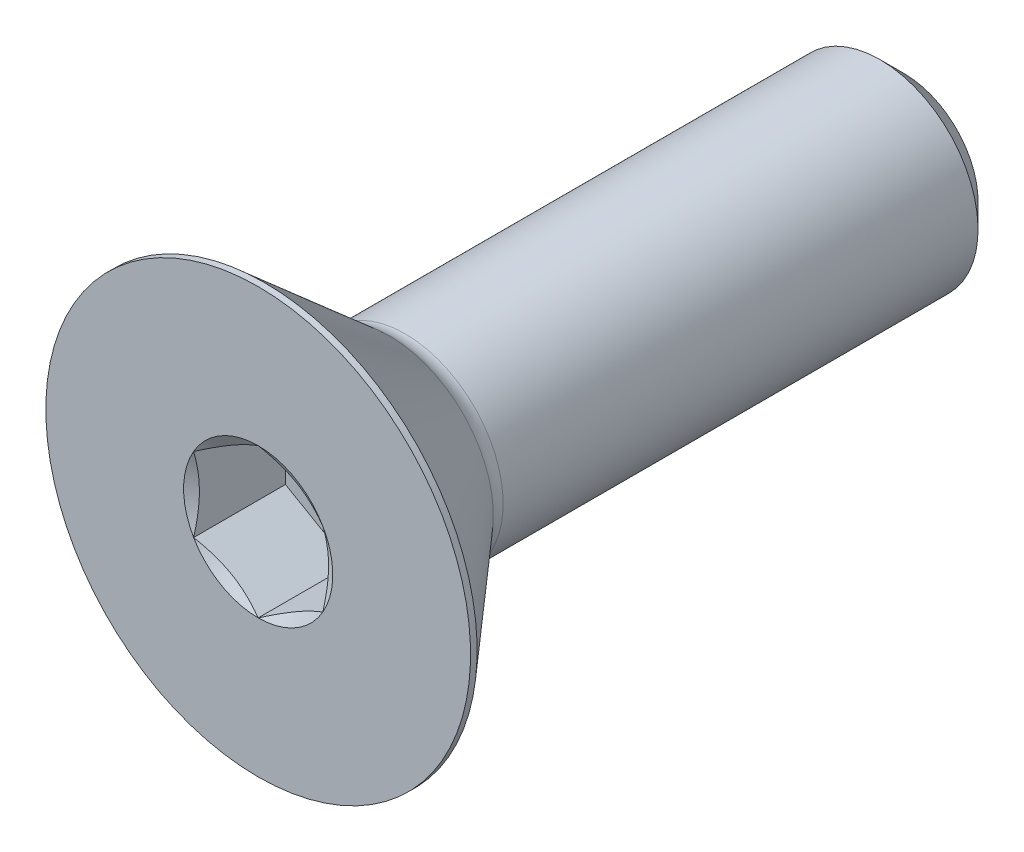
ISO-10303-21;
HEADER;
FILE_DESCRIPTION(('STEP AP214'),'2;1');
FILE_NAME('part.step','',(''),(''),'','','');
FILE_SCHEMA(('AUTOMOTIVE_DESIGN { 1 0 10303 214 1 1 1 1 }'));
ENDSEC;
DATA;
#1=APPLICATION_CONTEXT('core data for automotive mechanical design processes');
#2=APPLICATION_PROTOCOL_DEFINITION('international standard','automotive_design',2000,#1);
#3=PRODUCT_CONTEXT('',#1,'mechanical');
#4=PRODUCT('Part','Part','',(#3));
#5=PRODUCT_RELATED_PRODUCT_CATEGORY('part','',(#4));
#6=PRODUCT_DEFINITION_FORMATION('','',#4);
#7=PRODUCT_DEFINITION_CONTEXT('part definition',#1,'design');
#8=PRODUCT_DEFINITION('design','',#6,#7);
#9=PRODUCT_DEFINITION_SHAPE('','',#8);
#10=(LENGTH_UNIT() NAMED_UNIT(*) SI_UNIT(.MILLI.,.METRE.));
#11=(NAMED_UNIT(*) PLANE_ANGLE_UNIT() SI_UNIT($,.RADIAN.));
#12=(NAMED_UNIT(*) SI_UNIT($,.STERADIAN.) SOLID_ANGLE_UNIT());
#13=UNCERTAINTY_MEASURE_WITH_UNIT(LENGTH_MEASURE(1.E-05),#10,'distance_accuracy_value','');
#14=(GEOMETRIC_REPRESENTATION_CONTEXT(3) GLOBAL_UNCERTAINTY_ASSIGNED_CONTEXT((#13)) GLOBAL_UNIT_ASSIGNED_CONTEXT((#10,
#11,#12)) REPRESENTATION_CONTEXT('',''));
#15=CARTESIAN_POINT('',(0.,0.,0.));
#16=DIRECTION('',(0.,0.,1.));
#17=DIRECTION('',(1.,0.,0.));
#18=AXIS2_PLACEMENT_3D('',#15,#16,#17);
#19=CARTESIAN_POINT('',(0.,0.,-15.875));
#20=DIRECTION('',(0.,0.,-1.));
#21=DIRECTION('',(0.,1.,0.));
#22=AXIS2_PLACEMENT_3D('',#19,#20,#21);
#23=CYLINDRICAL_SURFACE('',#22,2.413);
#24=CARTESIAN_POINT('',(0.,0.,-15.2796875));
#25=DIRECTION('',(0.,0.,-1.));
#26=DIRECTION('',(0.,1.,0.));
#27=AXIS2_PLACEMENT_3D('',#24,#25,#26);
#28=CIRCLE('',#27,2.413);
#29=CARTESIAN_POINT('',(0.,2.41299999999999,-15.2796875));
#30=VERTEX_POINT('',#29);
#31=EDGE_CURVE('E50',#30,#30,#28,.F.);
#32=ORIENTED_EDGE('',*,*,#31,.T.);
#33=EDGE_LOOP('',(#32));
#34=FACE_BOUND('',#33,.T.);
#35=CARTESIAN_POINT('',(0.,0.,-3.60763457875702));
#36=DIRECTION('',(0.,0.,1.));
#37=DIRECTION('',(0.,-1.,0.));
#38=AXIS2_PLACEMENT_3D('',#35,#36,#37);
#39=CIRCLE('',#38,2.413);
#40=CARTESIAN_POINT('',(0.,-2.413,-3.60763457875702));
#41=VERTEX_POINT('',#40);
#42=EDGE_CURVE('E213',#41,#41,#39,.T.);
#43=ORIENTED_EDGE('',*,*,#42,.F.);
#44=EDGE_LOOP('',(#43));
#45=FACE_BOUND('',#44,.T.);
#46=ADVANCED_FACE('F36',(#34,#45),#23,.T.);
#47=CARTESIAN_POINT('',(0.,-2.41300000000001,-15.875));
#48=DIRECTION('',(0.,0.,-1.));
#49=DIRECTION('',(0.,1.,0.));
#50=AXIS2_PLACEMENT_3D('',#47,#48,#49);
#51=PLANE('',#50);
#52=CARTESIAN_POINT('',(0.,0.,-15.875));
#53=DIRECTION('',(0.,0.,-1.));
#54=DIRECTION('',(0.,1.,0.));
#55=AXIS2_PLACEMENT_3D('',#52,#53,#54);
#56=CIRCLE('',#55,1.8176875);
#57=CARTESIAN_POINT('',(0.,1.81768749999999,-15.875));
#58=VERTEX_POINT('',#57);
#59=EDGE_CURVE('E216',#58,#58,#56,.T.);
#60=ORIENTED_EDGE('',*,*,#59,.T.);
#61=EDGE_LOOP('',(#60));
#62=FACE_BOUND('',#61,.T.);
#63=ADVANCED_FACE('F226',(#62),#51,.T.);
#64=CARTESIAN_POINT('',(0.,0.,-15.875));
#65=DIRECTION('',(0.,0.,1.));
#66=DIRECTION('',(0.,-1.,0.));
#67=AXIS2_PLACEMENT_3D('',#64,#65,#66);
#68=CONICAL_SURFACE('',#67,1.8176875,0.785398163397446);
#69=ORIENTED_EDGE('',*,*,#31,.F.);
#70=EDGE_LOOP('',(#69));
#71=FACE_BOUND('',#70,.T.);
#72=ORIENTED_EDGE('',*,*,#59,.F.);
#73=EDGE_LOOP('',(#72));
#74=FACE_BOUND('',#73,.T.);
#75=ADVANCED_FACE('F38',(#71,#74),#68,.T.);
#76=CARTESIAN_POINT('',(0.,0.,-3.60763457875702));
#77=DIRECTION('',(0.,0.,1.));
#78=DIRECTION('',(0.,-1.,0.));
#79=AXIS2_PLACEMENT_3D('',#76,#77,#78);
#80=TOROIDAL_SURFACE('',#79,2.9950125352814,0.582012535281398);
#81=CARTESIAN_POINT('',(0.,0.,-3.2258));
#82=DIRECTION('',(0.,0.,1.));
#83=DIRECTION('',(0.,-1.,0.));
#84=AXIS2_PLACEMENT_3D('',#81,#82,#83);
#85=CIRCLE('',#84,2.55576209909478);
#86=CARTESIAN_POINT('',(0.,-2.55576209909478,-3.2258));
#87=VERTEX_POINT('',#86);
#88=EDGE_CURVE('E210',#87,#87,#85,.T.);
#89=ORIENTED_EDGE('',*,*,#88,.F.);
#90=EDGE_LOOP('',(#89));
#91=FACE_BOUND('',#90,.T.);
#92=ORIENTED_EDGE('',*,*,#42,.T.);
#93=EDGE_LOOP('',(#92));
#94=FACE_BOUND('',#93,.T.);
#95=ADVANCED_FACE('F225',(#91,#94),#80,.F.);
#96=CARTESIAN_POINT('',(0.,0.,-3.2258));
#97=DIRECTION('',(0.,0.,1.));
#98=DIRECTION('',(0.,-1.,0.));
#99=AXIS2_PLACEMENT_3D('',#96,#97,#98);
#100=CONICAL_SURFACE('',#99,2.55576209909478,0.715584993317677);
#101=CARTESIAN_POINT('',(0.,0.,-0.161289999999997));
#102=DIRECTION('',(0.,0.,1.));
#103=DIRECTION('',(0.,-1.,0.));
#104=AXIS2_PLACEMENT_3D('',#101,#102,#103);
#105=CIRCLE('',#104,5.2197);
#106=CARTESIAN_POINT('',(0.,-5.2197,-0.161289999999995));
#107=VERTEX_POINT('',#106);
#108=EDGE_CURVE('E207',#107,#107,#105,.T.);
#109=ORIENTED_EDGE('',*,*,#108,.F.);
#110=EDGE_LOOP('',(#109));
#111=FACE_BOUND('',#110,.T.);
#112=ORIENTED_EDGE('',*,*,#88,.T.);
#113=EDGE_LOOP('',(#112));
#114=FACE_BOUND('',#113,.T.);
#115=ADVANCED_FACE('F238',(#111,#114),#100,.T.);
#116=CARTESIAN_POINT('',(0.,0.,0.));
#117=DIRECTION('',(0.,0.,1.));
#118=DIRECTION('',(0.,-1.,0.));
#119=AXIS2_PLACEMENT_3D('',#116,#117,#118);
#120=CYLINDRICAL_SURFACE('',#119,5.2197);
#121=CARTESIAN_POINT('',(0.,0.,0.));
#122=DIRECTION('',(0.,0.,1.));
#123=DIRECTION('',(0.,-1.,0.));
#124=AXIS2_PLACEMENT_3D('',#121,#122,#123);
#125=CIRCLE('',#124,5.2197);
#126=CARTESIAN_POINT('',(0.,-5.2197,0.));
#127=VERTEX_POINT('',#126);
#128=EDGE_CURVE('E195',#127,#127,#125,.T.);
#129=ORIENTED_EDGE('',*,*,#128,.F.);
#130=EDGE_LOOP('',(#129));
#131=FACE_BOUND('',#130,.T.);
#132=ORIENTED_EDGE('',*,*,#108,.T.);
#133=EDGE_LOOP('',(#132));
#134=FACE_BOUND('',#133,.T.);
#135=ADVANCED_FACE('F168',(#131,#134),#120,.T.);
#136=CARTESIAN_POINT('',(0.,-2.413,0.));
#137=DIRECTION('',(0.,0.,1.));
#138=DIRECTION('',(0.,-1.,0.));
#139=AXIS2_PLACEMENT_3D('',#136,#137,#138);
#140=PLANE('',#139);
#141=CARTESIAN_POINT('',(0.,0.,0.));
#142=DIRECTION('',(0.,0.,1.));
#143=DIRECTION('',(1.,0.,0.));
#144=AXIS2_PLACEMENT_3D('',#141,#142,#143);
#145=CIRCLE('',#144,1.83308710467706);
#146=CARTESIAN_POINT('',(0.,-1.83308710467706,0.));
#147=VERTEX_POINT('',#146);
#148=CARTESIAN_POINT('',(1.5875,-0.916543552338532,0.));
#149=VERTEX_POINT('',#148);
#150=EDGE_CURVE('E63',#147,#149,#145,.T.);
#151=ORIENTED_EDGE('',*,*,#150,.F.);
#152=CARTESIAN_POINT('',(-1.5875,-0.916543552338531,0.));
#153=VERTEX_POINT('',#152);
#154=EDGE_CURVE('E135',#153,#147,#145,.T.);
#155=ORIENTED_EDGE('',*,*,#154,.F.);
#156=CARTESIAN_POINT('',(-1.5875,0.916543552338532,0.));
#157=VERTEX_POINT('',#156);
#158=EDGE_CURVE('E134',#157,#153,#145,.T.);
#159=ORIENTED_EDGE('',*,*,#158,.F.);
#160=CARTESIAN_POINT('',(0.,1.83308710467706,0.));
#161=VERTEX_POINT('',#160);
#162=EDGE_CURVE('E104',#161,#157,#145,.T.);
#163=ORIENTED_EDGE('',*,*,#162,.F.);
#164=CARTESIAN_POINT('',(1.5875,0.916543552338532,0.));
#165=VERTEX_POINT('',#164);
#166=EDGE_CURVE('E95',#165,#161,#145,.T.);
#167=ORIENTED_EDGE('',*,*,#166,.F.);
#168=EDGE_CURVE('E56',#149,#165,#145,.T.);
#169=ORIENTED_EDGE('',*,*,#168,.F.);
#170=EDGE_LOOP('',(#151,#155,#159,#163,#167,#169));
#171=FACE_BOUND('',#170,.T.);
#172=ORIENTED_EDGE('',*,*,#128,.T.);
#173=EDGE_LOOP('',(#172));
#174=FACE_BOUND('',#173,.T.);
#175=ADVANCED_FACE('F130',(#171,#174),#140,.T.);
#176=CARTESIAN_POINT('',(0.,0.,0.));
#177=DIRECTION('',(0.,0.,1.));
#178=DIRECTION('',(1.,0.,0.));
#179=AXIS2_PLACEMENT_3D('',#176,#177,#178);
#180=CONICAL_SURFACE('',#179,1.83308710467706,1.0471975511966);
#181=ORIENTED_EDGE('',*,*,#162,.T.);
#182=CARTESIAN_POINT('',(0.000200000000000386,1.8332025747309,6.66729654824168E-05));
#183=CARTESIAN_POINT('',(-0.0695643861628718,1.79292408759992,-0.0231992137193952));
#184=CARTESIAN_POINT('',(-0.139930970050585,1.75229792145039,-0.044359156288694));
#185=CARTESIAN_POINT('',(-0.281882763257892,1.6703420154302,-0.0812951199686376));
#186=CARTESIAN_POINT('',(-0.353470496003282,1.62901081865898,-0.0970580726413858));
#187=CARTESIAN_POINT('',(-0.49575870922636,1.54686068045212,-0.121596871089902));
#188=CARTESIAN_POINT('',(-0.56643728922707,1.50605438326277,-0.130536010682432));
#189=CARTESIAN_POINT('',(-0.708127238501279,1.42424965290784,-0.141210021970231));
#190=CARTESIAN_POINT('',(-0.779138092318986,1.3832515173408,-0.142953729982097));
#191=CARTESIAN_POINT('',(-0.911840615597941,1.30663567980356,-0.139337977188583));
#192=CARTESIAN_POINT('',(-0.9735520889249,1.27100654406615,-0.134866309891143));
#193=CARTESIAN_POINT('',(-1.09657296064314,1.19998041066368,-0.12069009289629));
#194=CARTESIAN_POINT('',(-1.15788193311235,1.16458365890484,-0.110980694458675));
#195=CARTESIAN_POINT('',(-1.28115671997609,1.09341092752477,-0.0867065110873971));
#196=CARTESIAN_POINT('',(-1.34310692153184,1.0576439619802,-0.0720387662927896));
#197=CARTESIAN_POINT('',(-1.46608302828098,0.986643673644695,-0.0387482016565166));
#198=CARTESIAN_POINT('',(-1.52711051058722,0.951409440307226,-0.0201332106099122));
#199=CARTESIAN_POINT('',(-1.5877,0.916428082284694,6.66729654825674E-05));
#200=B_SPLINE_CURVE_WITH_KNOTS('',3,(#182,#183,#184,#185,#186,#187,#188,#189,#190,#191,#192,
#193,#194,#195,#196,#197,#198,#199),.UNSPECIFIED.,.F.,.F.,(4,2,2,2,2,2,2,2,4),(0.,
0.251647272601204,0.503899652171032,0.749908024753695,0.995614197816256,1.20960574360963,
1.42379572923035,1.64273857632785,1.86125117688),.UNSPECIFIED.);
#201=EDGE_CURVE('E11',#161,#157,#200,.T.);
#202=ORIENTED_EDGE('',*,*,#201,.F.);
#203=EDGE_LOOP('',(#181,#202));
#204=FACE_BOUND('',#203,.T.);
#205=ADVANCED_FACE('F108',(#204),#180,.F.);
#206=ORIENTED_EDGE('',*,*,#158,.T.);
#207=CARTESIAN_POINT('',(-1.5875,-2.37354288027605,0.590288520873902));
#208=CARTESIAN_POINT('',(-1.5875,-2.30498906897407,0.557398984940117));
#209=CARTESIAN_POINT('',(-1.5875,-2.23626839223786,0.524851150026163));
#210=CARTESIAN_POINT('',(-1.5875,-2.09840401641784,0.460632506319268));
#211=CARTESIAN_POINT('',(-1.5875,-2.02926024390266,0.428961855361142));
#212=CARTESIAN_POINT('',(-1.5875,-1.89006393379529,0.366514274339718));
#213=CARTESIAN_POINT('',(-1.5875,-1.82000842787054,0.335743930997245));
#214=CARTESIAN_POINT('',(-1.5875,-1.6793106951035,0.275583740326318));
#215=CARTESIAN_POINT('',(-1.5875,-1.60866849899343,0.246193821218049));
#216=CARTESIAN_POINT('',(-1.5875,-1.46481905678083,0.188410359407913));
#217=CARTESIAN_POINT('',(-1.5875,-1.39159303106009,0.160062946359922));
#218=CARTESIAN_POINT('',(-1.5875,-1.24427117679401,0.105734456219238));
#219=CARTESIAN_POINT('',(-1.5875,-1.17017524056603,0.0797536756442557));
#220=CARTESIAN_POINT('',(-1.5875,-0.946703117236298,0.00645698206835824));
#221=CARTESIAN_POINT('',(-1.5875,-0.795733661821908,-0.0363852268942812));
#222=CARTESIAN_POINT('',(-1.5875,-0.56625881626827,-0.0860800833295957));
#223=CARTESIAN_POINT('',(-1.5875,-0.489336969230923,-0.100210543016601));
#224=CARTESIAN_POINT('',(-1.5875,-0.334627971891015,-0.122646627624216));
#225=CARTESIAN_POINT('',(-1.5875,-0.256840880424316,-0.130952646171579));
#226=CARTESIAN_POINT('',(-1.5875,-0.10176820748604,-0.14097154807732));
#227=CARTESIAN_POINT('',(-1.5875,-0.0244877840878075,-0.142762235102349));
#228=CARTESIAN_POINT('',(-1.5875,0.129945425556551,-0.139806441382949));
#229=CARTESIAN_POINT('',(-1.5875,0.2070982036032,-0.135059555855708));
#230=CARTESIAN_POINT('',(-1.5875,0.39746123117644,-0.115699504338589));
#231=CARTESIAN_POINT('',(-1.5875,0.510302581730162,-0.0974582143186722));
#232=CARTESIAN_POINT('',(-1.5875,0.73379094829414,-0.0504191906142847));
#233=CARTESIAN_POINT('',(-1.5875,0.844435149473762,-0.0216087338823727));
#234=CARTESIAN_POINT('',(-1.5875,1.00991571828403,0.0276065665647557));
#235=CARTESIAN_POINT('',(-1.5875,1.06560747491337,0.0452411407526782));
#236=CARTESIAN_POINT('',(-1.5875,1.17641127317168,0.0821415882281514));
#237=CARTESIAN_POINT('',(-1.5875,1.23152365277664,0.101406443459077));
#238=CARTESIAN_POINT('',(-1.5875,1.34124234685352,0.141287670660159));
#239=CARTESIAN_POINT('',(-1.5875,1.39584875124712,0.161903797012961));
#240=CARTESIAN_POINT('',(-1.5875,1.5046312801738,0.2042645699702));
#241=CARTESIAN_POINT('',(-1.5875,1.55880733021518,0.226009407242562));
#242=CARTESIAN_POINT('',(-1.5875,1.69709397430045,0.282906948481228));
#243=CARTESIAN_POINT('',(-1.5875,1.78092805766898,0.318730979496977));
#244=CARTESIAN_POINT('',(-1.5875,1.94783917261492,0.392105967732123));
#245=CARTESIAN_POINT('',(-1.5875,2.03091614691811,0.429657054322668));
#246=CARTESIAN_POINT('',(-1.5875,2.27926367299452,0.544292090654834));
#247=CARTESIAN_POINT('',(-1.5875,2.44362308741275,0.623346064593466));
#248=CARTESIAN_POINT('',(-1.5875,2.77093773989402,0.784769522596857));
#249=CARTESIAN_POINT('',(-1.5875,2.93389100335284,0.867142963080954));
#250=CARTESIAN_POINT('',(-1.5875,3.25868106672949,1.03400793046289));
#251=CARTESIAN_POINT('',(-1.5875,3.42051800525884,1.11849918813148));
#252=CARTESIAN_POINT('',(-1.5875,3.72818042196342,1.28089703230934));
#253=CARTESIAN_POINT('',(-1.5875,3.87407539856249,1.35867241102382));
#254=CARTESIAN_POINT('',(-1.5875,4.16539605096666,1.51510933862617));
#255=CARTESIAN_POINT('',(-1.5875,4.31082170914626,1.59377092030889));
#256=CARTESIAN_POINT('',(-1.5875,4.60094201771575,1.75155709578743));
#257=CARTESIAN_POINT('',(-1.5875,4.74563758660809,1.83068000299539));
#258=CARTESIAN_POINT('',(-1.5875,5.03473618489941,1.9894407922694));
#259=CARTESIAN_POINT('',(-1.5875,5.1791392292114,2.0690786471689));
#260=CARTESIAN_POINT('',(-1.5875,5.32343717609415,2.14890533452521));
#261=B_SPLINE_CURVE_WITH_KNOTS('',3,(#207,#208,#209,#210,#211,#212,#213,#214,#215,#216,#217,
#218,#219,#220,#221,#222,#223,#224,#225,#226,#227,#228,#229,#230,#231,#232,#233,#234,#235,#236,
#237,#238,#239,#240,#241,#242,#243,#244,#245,#246,#247,#248,#249,#250,#251,#252,#253,#254,#255,
#256,#257,#258,#259,#260),.UNSPECIFIED.,.F.,.F.,(4,2,2,2,2,2,2,2,2,2,2,2,2,2,2,2,2,2,2,2,2,2,2,
2,2,2,4),(0.,0.228108416316536,0.456257613800003,0.685790772408023,0.915311982421997,
1.15083308117179,1.38638364812083,1.85615598568852,2.09060484106677,2.3250378504203,
2.55666198604244,2.78830046363685,3.13051568227743,3.47314421494376,3.6483760219735,
3.82349919880257,3.99859063171139,4.17371173887894,4.44718606585054,4.72068091184658,
5.267760937063,5.81551351008619,6.36319679928459,6.85918646152392,7.35519453905289,
7.84994100628722,8.34466158226601),.UNSPECIFIED.);
#262=EDGE_CURVE('E103',#157,#153,#261,.F.);
#263=ORIENTED_EDGE('',*,*,#262,.F.);
#264=EDGE_LOOP('',(#206,#263));
#265=FACE_BOUND('',#264,.T.);
#266=ADVANCED_FACE('F266',(#265),#180,.F.);
#267=ORIENTED_EDGE('',*,*,#154,.T.);
#268=CARTESIAN_POINT('',(-1.5877,-0.916428082284693,6.66729654823681E-05));
#269=CARTESIAN_POINT('',(-1.51793561383713,-0.956706569415677,-0.0231992137193952));
#270=CARTESIAN_POINT('',(-1.44756902994941,-0.997332735565202,-0.044359156288694));
#271=CARTESIAN_POINT('',(-1.30561723674211,-1.07928864158539,-0.0812951199686376));
#272=CARTESIAN_POINT('',(-1.23402950399672,-1.12061983835662,-0.0970580726413858));
#273=CARTESIAN_POINT('',(-1.09174129077364,-1.20276997656347,-0.121596871089902));
#274=CARTESIAN_POINT('',(-1.02106271077293,-1.24357627375282,-0.130536010682432));
#275=CARTESIAN_POINT('',(-0.87937276149872,-1.32538100410775,-0.141210021970231));
#276=CARTESIAN_POINT('',(-0.808361907681014,-1.36637913967479,-0.142953729982098));
#277=CARTESIAN_POINT('',(-0.675659384402059,-1.44299497721204,-0.139337977188583));
#278=CARTESIAN_POINT('',(-0.6139479110751,-1.47862411294944,-0.134866309891143));
#279=CARTESIAN_POINT('',(-0.490927039356861,-1.54965024635191,-0.120690092896291));
#280=CARTESIAN_POINT('',(-0.429618066887653,-1.58504699811075,-0.110980694458675));
#281=CARTESIAN_POINT('',(-0.306343280023913,-1.65621972949082,-0.0867065110873976));
#282=CARTESIAN_POINT('',(-0.244393078468156,-1.69198669503539,-0.0720387662927899));
#283=CARTESIAN_POINT('',(-0.121416971719017,-1.7629869833709,-0.0387482016565168));
#284=CARTESIAN_POINT('',(-0.0603894894127837,-1.79822121670837,-0.0201332106099125));
#285=CARTESIAN_POINT('',(0.000199999999999921,-1.8332025747309,6.66729654820841E-05));
#286=B_SPLINE_CURVE_WITH_KNOTS('',3,(#268,#269,#270,#271,#272,#273,#274,#275,#276,#277,#278,
#279,#280,#281,#282,#283,#284,#285),.UNSPECIFIED.,.F.,.F.,(4,2,2,2,2,2,2,2,4),(0.,
0.251647272601204,0.503899652171032,0.749908024753695,0.995614197816256,1.20960574360963,
1.42379572923035,1.64273857632785,1.86125117688),.UNSPECIFIED.);
#287=EDGE_CURVE('E144',#153,#147,#286,.T.);
#288=ORIENTED_EDGE('',*,*,#287,.F.);
#289=EDGE_LOOP('',(#267,#288));
#290=FACE_BOUND('',#289,.T.);
#291=ADVANCED_FACE('F272',(#290),#180,.F.);
#292=ORIENTED_EDGE('',*,*,#150,.T.);
#293=CARTESIAN_POINT('',(-0.000199999999999964,-1.8332025747309,6.66729654822916E-05));
#294=CARTESIAN_POINT('',(0.0695643861628724,-1.79292408759992,-0.0231992137193953));
#295=CARTESIAN_POINT('',(0.139930970050586,-1.75229792145039,-0.0443591562886941));
#296=CARTESIAN_POINT('',(0.281882763257893,-1.6703420154302,-0.0812951199686378));
#297=CARTESIAN_POINT('',(0.353470496003282,-1.62901081865898,-0.0970580726413861));
#298=CARTESIAN_POINT('',(0.49575870922636,-1.54686068045212,-0.121596871089902));
#299=CARTESIAN_POINT('',(0.56643728922707,-1.50605438326277,-0.130536010682432));
#300=CARTESIAN_POINT('',(0.70812723850128,-1.42424965290784,-0.141210021970231));
#301=CARTESIAN_POINT('',(0.779138092318986,-1.3832515173408,-0.142953729982097));
#302=CARTESIAN_POINT('',(0.911840615597941,-1.30663567980356,-0.139337977188583));
#303=CARTESIAN_POINT('',(0.9735520889249,-1.27100654406615,-0.134866309891143));
#304=CARTESIAN_POINT('',(1.09657296064314,-1.19998041066368,-0.12069009289629));
#305=CARTESIAN_POINT('',(1.15788193311235,-1.16458365890484,-0.110980694458675));
#306=CARTESIAN_POINT('',(1.28115671997609,-1.09341092752477,-0.0867065110873972));
#307=CARTESIAN_POINT('',(1.34310692153184,-1.0576439619802,-0.0720387662927896));
#308=CARTESIAN_POINT('',(1.46608302828098,-0.986643673644695,-0.0387482016565165));
#309=CARTESIAN_POINT('',(1.52711051058722,-0.951409440307226,-0.0201332106099122));
#310=CARTESIAN_POINT('',(1.5877,-0.916428082284694,6.66729654826374E-05));
#311=B_SPLINE_CURVE_WITH_KNOTS('',3,(#293,#294,#295,#296,#297,#298,#299,#300,#301,#302,#303,
#304,#305,#306,#307,#308,#309,#310),.UNSPECIFIED.,.F.,.F.,(4,2,2,2,2,2,2,2,4),(0.,
0.251647272601204,0.503899652171032,0.749908024753695,0.995614197816256,1.20960574360963,
1.42379572923035,1.64273857632785,1.86125117688),.UNSPECIFIED.);
#312=EDGE_CURVE('E395',#147,#149,#311,.T.);
#313=ORIENTED_EDGE('',*,*,#312,.F.);
#314=EDGE_LOOP('',(#292,#313));
#315=FACE_BOUND('',#314,.T.);
#316=ADVANCED_FACE('F279',(#315),#180,.F.);
#317=ORIENTED_EDGE('',*,*,#168,.T.);
#318=CARTESIAN_POINT('',(1.5875,-2.37354288112975,0.590288521283596));
#319=CARTESIAN_POINT('',(1.5875,-2.30498906979859,0.55739898533216));
#320=CARTESIAN_POINT('',(1.5875,-2.23626839303319,0.524851150400567));
#321=CARTESIAN_POINT('',(1.5875,-2.09840401715466,0.460632506658494));
#322=CARTESIAN_POINT('',(1.5875,-2.02926024461018,0.428961855682829));
#323=CARTESIAN_POINT('',(1.5875,-1.89006393444365,0.366514274626302));
#324=CARTESIAN_POINT('',(1.5875,-1.82000842848903,0.33574393126627));
#325=CARTESIAN_POINT('',(1.5875,-1.67931069566203,0.275583740560567));
#326=CARTESIAN_POINT('',(1.5875,-1.60866849952187,0.246193821435082));
#327=CARTESIAN_POINT('',(1.5875,-1.46481905724732,0.188410359590401));
#328=CARTESIAN_POINT('',(1.5875,-1.3915930314947,0.16006294652511));
#329=CARTESIAN_POINT('',(1.5875,-1.24427117716434,0.105734456350902));
#330=CARTESIAN_POINT('',(1.5875,-1.17017524090393,0.0797536757596959));
#331=CARTESIAN_POINT('',(1.5875,-0.946703117476098,0.00645698213775835));
#332=CARTESIAN_POINT('',(1.5875,-0.795733661994794,-0.0363852268522568));
#333=CARTESIAN_POINT('',(1.5875,-0.56625881632816,-0.0860800833189004));
#334=CARTESIAN_POINT('',(1.5875,-0.489336969246159,-0.100210543015157));
#335=CARTESIAN_POINT('',(1.5875,-0.334627971816003,-0.12264662763433));
#336=CARTESIAN_POINT('',(1.5875,-0.25684088030371,-0.130952646184005));
#337=CARTESIAN_POINT('',(1.5875,-0.101768207275095,-0.140971548086378));
#338=CARTESIAN_POINT('',(1.5875,-0.0244877838321218,-0.142762235105857));
#339=CARTESIAN_POINT('',(1.5875,0.129945425900878,-0.139806441367941));
#340=CARTESIAN_POINT('',(1.5875,0.207098203991427,-0.13505955582773));
#341=CARTESIAN_POINT('',(1.5875,0.397461231636024,-0.115699504274904));
#342=CARTESIAN_POINT('',(1.5875,0.5103025822167,-0.0974582142330029));
#343=CARTESIAN_POINT('',(1.5875,0.733790948832869,-0.0504191904839962));
#344=CARTESIAN_POINT('',(1.5875,0.844435150037725,-0.0216087337294441));
#345=CARTESIAN_POINT('',(1.5875,1.00991571888582,0.0276065667512662));
#346=CARTESIAN_POINT('',(1.5875,1.06560747552801,0.0452411409504828));
#347=CARTESIAN_POINT('',(1.5875,1.1764112738119,0.0821415884482534));
#348=CARTESIAN_POINT('',(1.5875,1.23152365342958,0.101406443690182));
#349=CARTESIAN_POINT('',(1.5875,1.34124234753185,0.141287670912952));
#350=CARTESIAN_POINT('',(1.5875,1.39584875193812,0.161903797276436));
#351=CARTESIAN_POINT('',(1.5875,1.50463128089013,0.204264570254742));
#352=CARTESIAN_POINT('',(1.5875,1.55880733094418,0.226009407537489));
#353=CARTESIAN_POINT('',(1.5875,1.69709397503786,0.282906948792492));
#354=CARTESIAN_POINT('',(1.5875,1.7809280584024,0.318730979813345));
#355=CARTESIAN_POINT('',(1.5875,1.94783917334089,0.392105968057279));
#356=CARTESIAN_POINT('',(1.5875,2.03091614764059,0.429657054651507));
#357=CARTESIAN_POINT('',(1.5875,2.27926367370709,0.544292090993175));
#358=CARTESIAN_POINT('',(1.5875,2.44362308811947,0.623346064936107));
#359=CARTESIAN_POINT('',(1.5875,2.77093774058975,0.784769522945813));
#360=CARTESIAN_POINT('',(1.5875,2.93389100404345,0.867142963431916));
#361=CARTESIAN_POINT('',(1.5875,3.25868106741049,1.03400793081661));
#362=CARTESIAN_POINT('',(1.5875,3.42051800593536,1.11849918848595));
#363=CARTESIAN_POINT('',(1.5875,3.72818042263587,1.28089703266666));
#364=CARTESIAN_POINT('',(1.5875,3.87407539923529,1.35867241138334));
#365=CARTESIAN_POINT('',(1.5875,4.16539605164035,1.51510933898971));
#366=CARTESIAN_POINT('',(1.5875,4.31082170982049,1.59377092067423));
#367=CARTESIAN_POINT('',(1.5875,4.60094201839169,1.75155709615639));
#368=CARTESIAN_POINT('',(1.5875,4.7456375872852,1.83068000336617));
#369=CARTESIAN_POINT('',(1.5875,5.03473618557898,1.98944079264363));
#370=CARTESIAN_POINT('',(1.5875,5.17913922989226,2.06907864754476));
#371=CARTESIAN_POINT('',(1.5875,5.32343717677633,2.14890533490264));
#372=B_SPLINE_CURVE_WITH_KNOTS('',3,(#318,#319,#320,#321,#322,#323,#324,#325,#326,#327,#328,
#329,#330,#331,#332,#333,#334,#335,#336,#337,#338,#339,#340,#341,#342,#343,#344,#345,#346,#347,
#348,#349,#350,#351,#352,#353,#354,#355,#356,#357,#358,#359,#360,#361,#362,#363,#364,#365,#366,
#367,#368,#369,#370,#371),.UNSPECIFIED.,.F.,.F.,(4,2,2,2,2,2,2,2,2,2,2,2,2,2,2,2,2,2,2,2,2,2,2,
2,2,2,4),(0.,0.228108416418353,0.456257614003655,0.685790772714889,0.915311982832067,
1.15083308168973,1.38638364874667,1.85615598652891,2.09060484204362,2.32503785153342,
2.55666198728886,2.7883004650167,3.13051568374753,3.47314421650436,3.6483760235811,
3.82349920045711,3.9985906334128,4.17371174062724,4.44718606759393,4.72068091358503,
5.26776093879132,5.81551351180353,6.36319680099107,6.85918646323444,7.35519454076741,
7.84994100800745,8.34466158399198),.UNSPECIFIED.);
#373=EDGE_CURVE('E120',#149,#165,#372,.T.);
#374=ORIENTED_EDGE('',*,*,#373,.F.);
#375=EDGE_LOOP('',(#317,#374));
#376=FACE_BOUND('',#375,.T.);
#377=ADVANCED_FACE('F286',(#376),#180,.F.);
#378=ORIENTED_EDGE('',*,*,#166,.T.);
#379=CARTESIAN_POINT('',(1.5877,0.916428082284694,6.66729654824935E-05));
#380=CARTESIAN_POINT('',(1.51793561383713,0.956706569415677,-0.0231992137193951));
#381=CARTESIAN_POINT('',(1.44756902994941,0.997332735565203,-0.0443591562886939));
#382=CARTESIAN_POINT('',(1.30561723674211,1.07928864158539,-0.0812951199686375));
#383=CARTESIAN_POINT('',(1.23402950399672,1.12061983835662,-0.0970580726413857));
#384=CARTESIAN_POINT('',(1.09174129077364,1.20276997656347,-0.121596871089902));
#385=CARTESIAN_POINT('',(1.02106271077293,1.24357627375282,-0.130536010682431));
#386=CARTESIAN_POINT('',(0.87937276149872,1.32538100410775,-0.14121002197023));
#387=CARTESIAN_POINT('',(0.808361907681014,1.36637913967479,-0.142953729982097));
#388=CARTESIAN_POINT('',(0.675659384402058,1.44299497721204,-0.139337977188583));
#389=CARTESIAN_POINT('',(0.613947911075099,1.47862411294945,-0.134866309891143));
#390=CARTESIAN_POINT('',(0.49092703935686,1.54965024635191,-0.12069009289629));
#391=CARTESIAN_POINT('',(0.429618066887652,1.58504699811075,-0.110980694458675));
#392=CARTESIAN_POINT('',(0.306343280023913,1.65621972949082,-0.0867065110873973));
#393=CARTESIAN_POINT('',(0.244393078468155,1.69198669503539,-0.0720387662927896));
#394=CARTESIAN_POINT('',(0.121416971719016,1.7629869833709,-0.0387482016565166));
#395=CARTESIAN_POINT('',(0.0603894894127835,1.79822121670837,-0.0201332106099123));
#396=CARTESIAN_POINT('',(-0.000199999999999628,1.8332025747309,6.66729654824418E-05));
#397=B_SPLINE_CURVE_WITH_KNOTS('',3,(#379,#380,#381,#382,#383,#384,#385,#386,#387,#388,#389,
#390,#391,#392,#393,#394,#395,#396),.UNSPECIFIED.,.F.,.F.,(4,2,2,2,2,2,2,2,4),(0.,
0.251647272601204,0.503899652171032,0.749908024753695,0.995614197816256,1.20960574360963,
1.42379572923035,1.64273857632785,1.86125117688),.UNSPECIFIED.);
#398=EDGE_CURVE('E99',#165,#161,#397,.T.);
#399=ORIENTED_EDGE('',*,*,#398,.F.);
#400=EDGE_LOOP('',(#378,#399));
#401=FACE_BOUND('',#400,.T.);
#402=ADVANCED_FACE('F97',(#401),#180,.F.);
#403=CARTESIAN_POINT('',(0.,1.83308710467706,-2.25806));
#404=DIRECTION('',(0.,0.,1.));
#405=DIRECTION('',(1.,0.,0.));
#406=AXIS2_PLACEMENT_3D('',#403,#404,#405);
#407=PLANE('',#406);
#408=DIRECTION('',(-0.866025403784439,0.5,0.));
#409=VECTOR('',#408,1.);
#410=CARTESIAN_POINT('',(1.5875,0.916543552338532,-2.25806));
#411=LINE('',#410,#409);
#412=CARTESIAN_POINT('',(1.5875,0.916543552338532,-2.25806));
#413=VERTEX_POINT('',#412);
#414=CARTESIAN_POINT('',(0.,1.83308710467706,-2.25806));
#415=VERTEX_POINT('',#414);
#416=EDGE_CURVE('E119',#413,#415,#411,.T.);
#417=ORIENTED_EDGE('',*,*,#416,.T.);
#418=DIRECTION('',(-0.866025403784439,-0.499999999999999,0.));
#419=VECTOR('',#418,1.);
#420=CARTESIAN_POINT('',(0.,1.83308710467706,-2.25806));
#421=LINE('',#420,#419);
#422=CARTESIAN_POINT('',(-1.5875,0.916543552338532,-2.25806));
#423=VERTEX_POINT('',#422);
#424=EDGE_CURVE('E124',#415,#423,#421,.T.);
#425=ORIENTED_EDGE('',*,*,#424,.T.);
#426=DIRECTION('',(0.,-1.,0.));
#427=VECTOR('',#426,1.);
#428=CARTESIAN_POINT('',(-1.5875,0.916543552338532,-2.25806));
#429=LINE('',#428,#427);
#430=CARTESIAN_POINT('',(-1.5875,-0.916543552338531,-2.25806));
#431=VERTEX_POINT('',#430);
#432=EDGE_CURVE('E183',#423,#431,#429,.T.);
#433=ORIENTED_EDGE('',*,*,#432,.T.);
#434=DIRECTION('',(0.866025403784439,-0.5,0.));
#435=VECTOR('',#434,1.);
#436=CARTESIAN_POINT('',(-1.5875,-0.916543552338531,-2.25806));
#437=LINE('',#436,#435);
#438=CARTESIAN_POINT('',(0.,-1.83308710467706,-2.25806));
#439=VERTEX_POINT('',#438);
#440=EDGE_CURVE('E186',#431,#439,#437,.T.);
#441=ORIENTED_EDGE('',*,*,#440,.T.);
#442=DIRECTION('',(0.866025403784439,0.5,0.));
#443=VECTOR('',#442,1.);
#444=CARTESIAN_POINT('',(0.,-1.83308710467706,-2.25806));
#445=LINE('',#444,#443);
#446=CARTESIAN_POINT('',(1.5875,-0.916543552338532,-2.25806));
#447=VERTEX_POINT('',#446);
#448=EDGE_CURVE('E189',#439,#447,#445,.T.);
#449=ORIENTED_EDGE('',*,*,#448,.T.);
#450=DIRECTION('',(0.,1.,0.));
#451=VECTOR('',#450,1.);
#452=CARTESIAN_POINT('',(1.5875,-0.916543552338532,-2.25806));
#453=LINE('',#452,#451);
#454=EDGE_CURVE('E127',#447,#413,#453,.T.);
#455=ORIENTED_EDGE('',*,*,#454,.T.);
#456=EDGE_LOOP('',(#417,#425,#433,#441,#449,#455));
#457=FACE_BOUND('',#456,.T.);
#458=ADVANCED_FACE('F163',(#457),#407,.T.);
#459=CARTESIAN_POINT('',(0.,1.83308710467706,-2.25806));
#460=DIRECTION('',(-0.5,0.866025403784439,0.));
#461=DIRECTION('',(-0.866025403784439,-0.5,0.));
#462=AXIS2_PLACEMENT_3D('',#459,#460,#461);
#463=PLANE('',#462);
#464=DIRECTION('',(0.,0.,1.));
#465=VECTOR('',#464,1.);
#466=CARTESIAN_POINT('',(0.,1.83308710467706,-2.25806));
#467=LINE('',#466,#465);
#468=EDGE_CURVE('E116',#415,#161,#467,.T.);
#469=ORIENTED_EDGE('',*,*,#468,.T.);
#470=ORIENTED_EDGE('',*,*,#201,.T.);
#471=DIRECTION('',(0.,0.,1.));
#472=VECTOR('',#471,1.);
#473=CARTESIAN_POINT('',(-1.5875,0.916543552338532,-2.25806));
#474=LINE('',#473,#472);
#475=EDGE_CURVE('E126',#423,#157,#474,.T.);
#476=ORIENTED_EDGE('',*,*,#475,.F.);
#477=ORIENTED_EDGE('',*,*,#424,.F.);
#478=EDGE_LOOP('',(#469,#470,#476,#477));
#479=FACE_BOUND('',#478,.T.);
#480=ADVANCED_FACE('F122',(#479),#463,.F.);
#481=CARTESIAN_POINT('',(-1.5875,0.916543552338532,-2.25806));
#482=DIRECTION('',(-1.,0.,0.));
#483=DIRECTION('',(0.,-1.,0.));
#484=AXIS2_PLACEMENT_3D('',#481,#482,#483);
#485=PLANE('',#484);
#486=ORIENTED_EDGE('',*,*,#475,.T.);
#487=ORIENTED_EDGE('',*,*,#262,.T.);
#488=DIRECTION('',(0.,0.,1.));
#489=VECTOR('',#488,1.);
#490=CARTESIAN_POINT('',(-1.5875,-0.916543552338531,-2.25806));
#491=LINE('',#490,#489);
#492=EDGE_CURVE('E202',#431,#153,#491,.T.);
#493=ORIENTED_EDGE('',*,*,#492,.F.);
#494=ORIENTED_EDGE('',*,*,#432,.F.);
#495=EDGE_LOOP('',(#486,#487,#493,#494));
#496=FACE_BOUND('',#495,.T.);
#497=ADVANCED_FACE('F153',(#496),#485,.F.);
#498=CARTESIAN_POINT('',(-1.5875,-0.916543552338531,-2.25806));
#499=DIRECTION('',(-0.5,-0.866025403784439,0.));
#500=DIRECTION('',(0.866025403784439,-0.5,0.));
#501=AXIS2_PLACEMENT_3D('',#498,#499,#500);
#502=PLANE('',#501);
#503=ORIENTED_EDGE('',*,*,#492,.T.);
#504=ORIENTED_EDGE('',*,*,#287,.T.);
#505=DIRECTION('',(0.,0.,1.));
#506=VECTOR('',#505,1.);
#507=CARTESIAN_POINT('',(0.,-1.83308710467706,-2.25806));
#508=LINE('',#507,#506);
#509=EDGE_CURVE('E199',#439,#147,#508,.T.);
#510=ORIENTED_EDGE('',*,*,#509,.F.);
#511=ORIENTED_EDGE('',*,*,#440,.F.);
#512=EDGE_LOOP('',(#503,#504,#510,#511));
#513=FACE_BOUND('',#512,.T.);
#514=ADVANCED_FACE('F156',(#513),#502,.F.);
#515=CARTESIAN_POINT('',(0.,-1.83308710467706,-2.25806));
#516=DIRECTION('',(0.5,-0.866025403784439,0.));
#517=DIRECTION('',(0.866025403784439,0.5,0.));
#518=AXIS2_PLACEMENT_3D('',#515,#516,#517);
#519=PLANE('',#518);
#520=ORIENTED_EDGE('',*,*,#509,.T.);
#521=ORIENTED_EDGE('',*,*,#312,.T.);
#522=DIRECTION('',(0.,0.,1.));
#523=VECTOR('',#522,1.);
#524=CARTESIAN_POINT('',(1.5875,-0.916543552338532,-2.25806));
#525=LINE('',#524,#523);
#526=EDGE_CURVE('E196',#447,#149,#525,.T.);
#527=ORIENTED_EDGE('',*,*,#526,.F.);
#528=ORIENTED_EDGE('',*,*,#448,.F.);
#529=EDGE_LOOP('',(#520,#521,#527,#528));
#530=FACE_BOUND('',#529,.T.);
#531=ADVANCED_FACE('F315',(#530),#519,.F.);
#532=CARTESIAN_POINT('',(1.5875,-0.916543552338532,-2.25806));
#533=DIRECTION('',(1.,0.,0.));
#534=DIRECTION('',(0.,1.,0.));
#535=AXIS2_PLACEMENT_3D('',#532,#533,#534);
#536=PLANE('',#535);
#537=ORIENTED_EDGE('',*,*,#526,.T.);
#538=ORIENTED_EDGE('',*,*,#373,.T.);
#539=DIRECTION('',(0.,0.,1.));
#540=VECTOR('',#539,1.);
#541=CARTESIAN_POINT('',(1.5875,0.916543552338532,-2.25806));
#542=LINE('',#541,#540);
#543=EDGE_CURVE('E118',#413,#165,#542,.T.);
#544=ORIENTED_EDGE('',*,*,#543,.F.);
#545=ORIENTED_EDGE('',*,*,#454,.F.);
#546=EDGE_LOOP('',(#537,#538,#544,#545));
#547=FACE_BOUND('',#546,.T.);
#548=ADVANCED_FACE('F167',(#547),#536,.F.);
#549=CARTESIAN_POINT('',(1.5875,0.916543552338532,-2.25806));
#550=DIRECTION('',(0.5,0.866025403784439,0.));
#551=DIRECTION('',(-0.866025403784439,0.5,0.));
#552=AXIS2_PLACEMENT_3D('',#549,#550,#551);
#553=PLANE('',#552);
#554=ORIENTED_EDGE('',*,*,#543,.T.);
#555=ORIENTED_EDGE('',*,*,#398,.T.);
#556=ORIENTED_EDGE('',*,*,#468,.F.);
#557=ORIENTED_EDGE('',*,*,#416,.F.);
#558=EDGE_LOOP('',(#554,#555,#556,#557));
#559=FACE_BOUND('',#558,.T.);
#560=ADVANCED_FACE('F114',(#559),#553,.F.);
#561=CLOSED_SHELL('',(#46,#63,#75,#95,#115,#135,#175,#205,#266,#291,#316,#377,#402,#458,#480,
#497,#514,#531,#548,#560));
#562=MANIFOLD_SOLID_BREP('B2',#561);
#563=ADVANCED_BREP_SHAPE_REPRESENTATION('',(#18,#562),#14);
#564=SHAPE_DEFINITION_REPRESENTATION(#9,#563);
ENDSEC;
END-ISO-10303-21;
